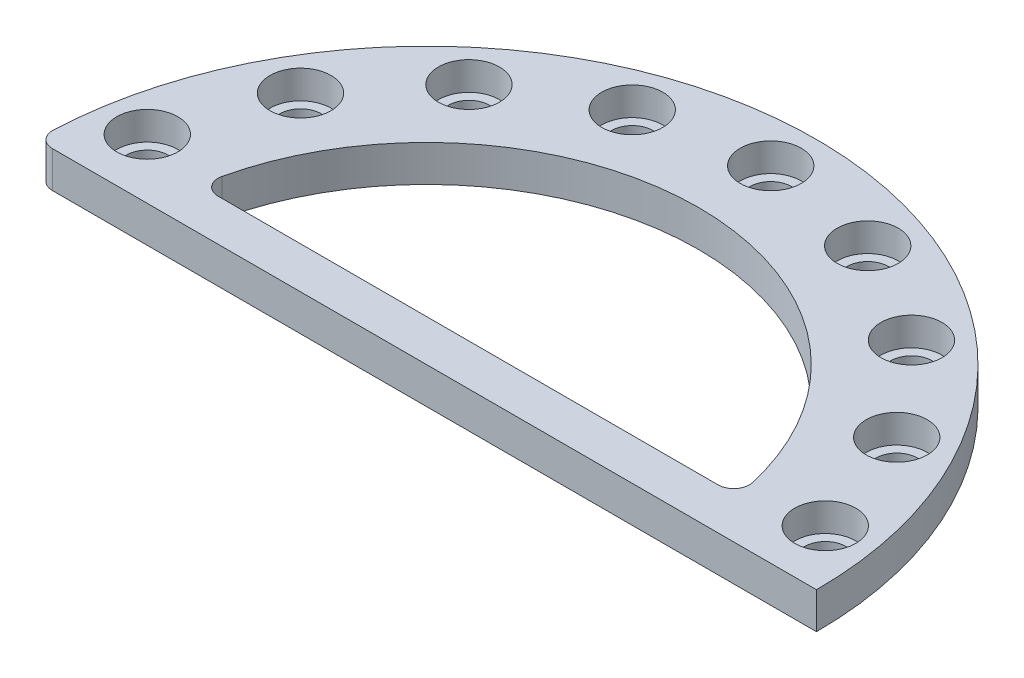
ISO-10303-21;
HEADER;
FILE_DESCRIPTION(('STEP AP214'),'2;1');
FILE_NAME('part.step','',(''),(''),'','','');
FILE_SCHEMA(('AUTOMOTIVE_DESIGN { 1 0 10303 214 1 1 1 1 }'));
ENDSEC;
DATA;
#1=APPLICATION_CONTEXT('core data for automotive mechanical design processes');
#2=APPLICATION_PROTOCOL_DEFINITION('international standard','automotive_design',2000,#1);
#3=PRODUCT_CONTEXT('',#1,'mechanical');
#4=PRODUCT('Part','Part','',(#3));
#5=PRODUCT_RELATED_PRODUCT_CATEGORY('part','',(#4));
#6=PRODUCT_DEFINITION_FORMATION('','',#4);
#7=PRODUCT_DEFINITION_CONTEXT('part definition',#1,'design');
#8=PRODUCT_DEFINITION('design','',#6,#7);
#9=PRODUCT_DEFINITION_SHAPE('','',#8);
#10=(LENGTH_UNIT() NAMED_UNIT(*) SI_UNIT(.MILLI.,.METRE.));
#11=(NAMED_UNIT(*) PLANE_ANGLE_UNIT() SI_UNIT($,.RADIAN.));
#12=(NAMED_UNIT(*) SI_UNIT($,.STERADIAN.) SOLID_ANGLE_UNIT());
#13=UNCERTAINTY_MEASURE_WITH_UNIT(LENGTH_MEASURE(1.E-05),#10,'distance_accuracy_value','');
#14=(GEOMETRIC_REPRESENTATION_CONTEXT(3) GLOBAL_UNCERTAINTY_ASSIGNED_CONTEXT((#13)) GLOBAL_UNIT_ASSIGNED_CONTEXT((#10,
#11,#12)) REPRESENTATION_CONTEXT('',''));
#15=CARTESIAN_POINT('',(0.,0.,0.));
#16=DIRECTION('',(0.,0.,1.));
#17=DIRECTION('',(1.,0.,0.));
#18=AXIS2_PLACEMENT_3D('',#15,#16,#17);
#19=CARTESIAN_POINT('',(0.,0.,0.));
#20=DIRECTION('',(0.,0.,1.));
#21=DIRECTION('',(1.,0.,0.));
#22=AXIS2_PLACEMENT_3D('',#19,#20,#21);
#23=PLANE('',#22);
#24=DIRECTION('',(1.,0.,0.));
#25=VECTOR('',#24,1.);
#26=CARTESIAN_POINT('',(0.,7.,0.));
#27=LINE('',#26,#25);
#28=CARTESIAN_POINT('',(-71.9374728496908,7.,0.));
#29=VERTEX_POINT('',#28);
#30=CARTESIAN_POINT('',(75.,7.,0.));
#31=VERTEX_POINT('',#30);
#32=EDGE_CURVE('E95',#29,#31,#27,.T.);
#33=ORIENTED_EDGE('',*,*,#32,.F.);
#34=DIRECTION('',(0.,1.,0.));
#35=VECTOR('',#34,1.);
#36=CARTESIAN_POINT('',(-71.9374728496908,0.,0.));
#37=LINE('',#36,#35);
#38=CARTESIAN_POINT('',(-71.9374728496908,0.,0.));
#39=VERTEX_POINT('',#38);
#40=EDGE_CURVE('E127',#29,#39,#37,.F.);
#41=ORIENTED_EDGE('',*,*,#40,.T.);
#42=DIRECTION('',(1.,0.,0.));
#43=VECTOR('',#42,1.);
#44=CARTESIAN_POINT('',(0.,0.,0.));
#45=LINE('',#44,#43);
#46=CARTESIAN_POINT('',(75.,0.,0.));
#47=VERTEX_POINT('',#46);
#48=EDGE_CURVE('E104',#39,#47,#45,.T.);
#49=ORIENTED_EDGE('',*,*,#48,.T.);
#50=DIRECTION('',(0.,-1.,0.));
#51=VECTOR('',#50,1.);
#52=CARTESIAN_POINT('',(75.,7.,0.));
#53=LINE('',#52,#51);
#54=EDGE_CURVE('E108',#47,#31,#53,.F.);
#55=ORIENTED_EDGE('',*,*,#54,.T.);
#56=EDGE_LOOP('',(#33,#41,#49,#55));
#57=FACE_BOUND('',#56,.T.);
#58=ADVANCED_FACE('F36',(#57),#23,.T.);
#59=CARTESIAN_POINT('',(0.,7.,0.));
#60=DIRECTION('',(0.,1.,0.));
#61=DIRECTION('',(0.,0.,1.));
#62=AXIS2_PLACEMENT_3D('',#59,#60,#61);
#63=PLANE('',#62);
#64=DIRECTION('',(1.,0.,0.));
#65=VECTOR('',#64,1.);
#66=CARTESIAN_POINT('',(-51.7098213591964,7.,-8.));
#67=LINE('',#66,#65);
#68=CARTESIAN_POINT('',(-48.0827996793032,7.,-8.));
#69=VERTEX_POINT('',#68);
#70=CARTESIAN_POINT('',(48.0827996793032,7.,-8.));
#71=VERTEX_POINT('',#70);
#72=EDGE_CURVE('E115',#69,#71,#67,.T.);
#73=ORIENTED_EDGE('',*,*,#72,.F.);
#74=CARTESIAN_POINT('',(-48.0827996793032,7.,-11.));
#75=DIRECTION('',(0.,1.,0.));
#76=DIRECTION('',(0.,0.,1.));
#77=AXIS2_PLACEMENT_3D('',#74,#75,#76);
#78=CIRCLE('',#77,3.);
#79=CARTESIAN_POINT('',(-51.0072477084549,7.,-11.6690319310694));
#80=VERTEX_POINT('',#79);
#81=EDGE_CURVE('E12',#69,#80,#78,.F.);
#82=ORIENTED_EDGE('',*,*,#81,.T.);
#83=CARTESIAN_POINT('',(0.,7.,0.));
#84=DIRECTION('',(0.,1.,0.));
#85=DIRECTION('',(0.,0.,1.));
#86=AXIS2_PLACEMENT_3D('',#83,#84,#85);
#87=CIRCLE('',#86,52.325);
#88=CARTESIAN_POINT('',(51.0072477084549,7.,-11.6690319310694));
#89=VERTEX_POINT('',#88);
#90=EDGE_CURVE('E152',#89,#80,#87,.T.);
#91=ORIENTED_EDGE('',*,*,#90,.F.);
#92=CARTESIAN_POINT('',(48.0827996793032,7.,-11.));
#93=DIRECTION('',(0.,1.,0.));
#94=DIRECTION('',(0.,0.,1.));
#95=AXIS2_PLACEMENT_3D('',#92,#93,#94);
#96=CIRCLE('',#95,3.);
#97=EDGE_CURVE('E134',#89,#71,#96,.F.);
#98=ORIENTED_EDGE('',*,*,#97,.T.);
#99=EDGE_LOOP('',(#73,#82,#91,#98));
#100=FACE_BOUND('',#99,.T.);
#101=CARTESIAN_POINT('',(0.,7.,-66.2));
#102=DIRECTION('',(0.,1.,0.));
#103=DIRECTION('',(0.,0.,1.));
#104=AXIS2_PLACEMENT_3D('',#101,#102,#103);
#105=CIRCLE('',#104,5.875);
#106=CARTESIAN_POINT('',(0.,7.,-60.325));
#107=VERTEX_POINT('',#106);
#108=EDGE_CURVE('E167',#107,#107,#105,.T.);
#109=ORIENTED_EDGE('',*,*,#108,.F.);
#110=EDGE_LOOP('',(#109));
#111=FACE_BOUND('',#110,.T.);
#112=CARTESIAN_POINT('',(22.6417334881593,7.,-62.2076514960271));
#113=DIRECTION('',(0.,1.,0.));
#114=DIRECTION('',(-0.342020143325669,0.,0.939692620785908));
#115=AXIS2_PLACEMENT_3D('',#112,#113,#114);
#116=CIRCLE('',#115,5.875);
#117=CARTESIAN_POINT('',(20.632365146121,7.,-56.6869573489099));
#118=VERTEX_POINT('',#117);
#119=EDGE_CURVE('E180',#118,#118,#116,.T.);
#120=ORIENTED_EDGE('',*,*,#119,.F.);
#121=EDGE_LOOP('',(#120));
#122=FACE_BOUND('',#121,.T.);
#123=CARTESIAN_POINT('',(42.552539761249,7.,-50.7121421344763));
#124=DIRECTION('',(0.,1.,0.));
#125=DIRECTION('',(-0.642787609686541,0.,0.766044443118977));
#126=AXIS2_PLACEMENT_3D('',#123,#124,#125);
#127=CIRCLE('',#126,5.875);
#128=CARTESIAN_POINT('',(38.7761625543406,7.,-46.2116310311523));
#129=VERTEX_POINT('',#128);
#130=EDGE_CURVE('E223',#129,#129,#127,.T.);
#131=ORIENTED_EDGE('',*,*,#130,.F.);
#132=EDGE_LOOP('',(#131));
#133=FACE_BOUND('',#132,.T.);
#134=CARTESIAN_POINT('',(57.3308817305299,7.,-33.0999999999999));
#135=DIRECTION('',(0.,1.,0.));
#136=DIRECTION('',(-0.86602540378444,0.,0.499999999999998));
#137=AXIS2_PLACEMENT_3D('',#134,#135,#136);
#138=CIRCLE('',#137,5.875);
#139=CARTESIAN_POINT('',(52.2429824832963,7.,-30.1624999999999));
#140=VERTEX_POINT('',#139);
#141=EDGE_CURVE('E217',#140,#140,#138,.T.);
#142=ORIENTED_EDGE('',*,*,#141,.F.);
#143=EDGE_LOOP('',(#142));
#144=FACE_BOUND('',#143,.T.);
#145=CARTESIAN_POINT('',(65.1942732494082,7.,-11.4955093615506));
#146=DIRECTION('',(0.,1.,0.));
#147=DIRECTION('',(-0.984807753012209,0.,0.173648177666927));
#148=AXIS2_PLACEMENT_3D('',#145,#146,#147);
#149=CIRCLE('',#148,5.875);
#150=CARTESIAN_POINT('',(59.4085277004615,7.,-10.4753263177574));
#151=VERTEX_POINT('',#150);
#152=EDGE_CURVE('E211',#151,#151,#149,.T.);
#153=ORIENTED_EDGE('',*,*,#152,.F.);
#154=EDGE_LOOP('',(#153));
#155=FACE_BOUND('',#154,.T.);
#156=CARTESIAN_POINT('',(-65.194273249408,7.,-11.4955093615515));
#157=DIRECTION('',(0.,1.,0.));
#158=DIRECTION('',(0.984807753012206,0.,0.17364817766694));
#159=AXIS2_PLACEMENT_3D('',#156,#157,#158);
#160=CIRCLE('',#159,5.875);
#161=CARTESIAN_POINT('',(-59.4085277004613,7.,-10.4753263177582));
#162=VERTEX_POINT('',#161);
#163=EDGE_CURVE('E205',#162,#162,#160,.T.);
#164=ORIENTED_EDGE('',*,*,#163,.F.);
#165=EDGE_LOOP('',(#164));
#166=FACE_BOUND('',#165,.T.);
#167=CARTESIAN_POINT('',(-57.3308817305294,7.,-33.1000000000007));
#168=DIRECTION('',(0.,1.,0.));
#169=DIRECTION('',(0.866025403784433,0.,0.50000000000001));
#170=AXIS2_PLACEMENT_3D('',#167,#168,#169);
#171=CIRCLE('',#170,5.875);
#172=CARTESIAN_POINT('',(-52.2429824832959,7.,-30.1625000000006));
#173=VERTEX_POINT('',#172);
#174=EDGE_CURVE('E199',#173,#173,#171,.T.);
#175=ORIENTED_EDGE('',*,*,#174,.F.);
#176=EDGE_LOOP('',(#175));
#177=FACE_BOUND('',#176,.T.);
#178=CARTESIAN_POINT('',(-42.5525397612483,7.,-50.7121421344769));
#179=DIRECTION('',(0.,1.,0.));
#180=DIRECTION('',(0.64278760968653,0.,0.766044443118986));
#181=AXIS2_PLACEMENT_3D('',#178,#179,#180);
#182=CIRCLE('',#181,5.875);
#183=CARTESIAN_POINT('',(-38.7761625543399,7.,-46.2116310311528));
#184=VERTEX_POINT('',#183);
#185=EDGE_CURVE('E193',#184,#184,#182,.T.);
#186=ORIENTED_EDGE('',*,*,#185,.F.);
#187=EDGE_LOOP('',(#186));
#188=FACE_BOUND('',#187,.T.);
#189=CARTESIAN_POINT('',(-22.6417334881585,7.,-62.2076514960274));
#190=DIRECTION('',(0.,1.,0.));
#191=DIRECTION('',(0.342020143325657,0.,0.939692620785913));
#192=AXIS2_PLACEMENT_3D('',#189,#190,#191);
#193=CIRCLE('',#192,5.875);
#194=CARTESIAN_POINT('',(-20.6323651461203,7.,-56.6869573489102));
#195=VERTEX_POINT('',#194);
#196=EDGE_CURVE('E186',#195,#195,#193,.T.);
#197=ORIENTED_EDGE('',*,*,#196,.F.);
#198=EDGE_LOOP('',(#197));
#199=FACE_BOUND('',#198,.T.);
#200=CARTESIAN_POINT('',(0.,7.,0.));
#201=DIRECTION('',(0.,1.,0.));
#202=DIRECTION('',(0.,0.,1.));
#203=AXIS2_PLACEMENT_3D('',#200,#201,#202);
#204=CIRCLE('',#203,75.);
#205=CARTESIAN_POINT('',(-74.9348675517612,7.,-3.125));
#206=VERTEX_POINT('',#205);
#207=EDGE_CURVE('E97',#31,#206,#204,.T.);
#208=ORIENTED_EDGE('',*,*,#207,.T.);
#209=CARTESIAN_POINT('',(-71.9374728496908,7.,-3.));
#210=DIRECTION('',(0.,1.,0.));
#211=DIRECTION('',(0.,0.,1.));
#212=AXIS2_PLACEMENT_3D('',#209,#210,#211);
#213=CIRCLE('',#212,3.);
#214=EDGE_CURVE('E99',#206,#29,#213,.T.);
#215=ORIENTED_EDGE('',*,*,#214,.T.);
#216=ORIENTED_EDGE('',*,*,#32,.T.);
#217=EDGE_LOOP('',(#208,#215,#216));
#218=FACE_BOUND('',#217,.T.);
#219=ADVANCED_FACE('F96',(#100,#111,#122,#133,#144,#155,#166,#177,#188,#199,#218),#63,.T.);
#220=CARTESIAN_POINT('',(0.,0.,0.));
#221=DIRECTION('',(0.,1.,0.));
#222=DIRECTION('',(0.,0.,1.));
#223=AXIS2_PLACEMENT_3D('',#220,#221,#222);
#224=PLANE('',#223);
#225=DIRECTION('',(1.,0.,0.));
#226=VECTOR('',#225,1.);
#227=CARTESIAN_POINT('',(-51.7098213591964,0.,-8.));
#228=LINE('',#227,#226);
#229=CARTESIAN_POINT('',(-48.0827996793032,0.,-8.));
#230=VERTEX_POINT('',#229);
#231=CARTESIAN_POINT('',(48.0827996793032,0.,-8.));
#232=VERTEX_POINT('',#231);
#233=EDGE_CURVE('E141',#230,#232,#228,.T.);
#234=ORIENTED_EDGE('',*,*,#233,.T.);
#235=CARTESIAN_POINT('',(48.0827996793032,0.,-11.));
#236=DIRECTION('',(0.,1.,0.));
#237=DIRECTION('',(0.,0.,1.));
#238=AXIS2_PLACEMENT_3D('',#235,#236,#237);
#239=CIRCLE('',#238,3.);
#240=CARTESIAN_POINT('',(51.0072477084549,0.,-11.6690319310694));
#241=VERTEX_POINT('',#240);
#242=EDGE_CURVE('E132',#232,#241,#239,.T.);
#243=ORIENTED_EDGE('',*,*,#242,.T.);
#244=CARTESIAN_POINT('',(0.,0.,0.));
#245=DIRECTION('',(0.,1.,0.));
#246=DIRECTION('',(0.,0.,1.));
#247=AXIS2_PLACEMENT_3D('',#244,#245,#246);
#248=CIRCLE('',#247,52.325);
#249=CARTESIAN_POINT('',(-51.0072477084549,0.,-11.6690319310694));
#250=VERTEX_POINT('',#249);
#251=EDGE_CURVE('E143',#241,#250,#248,.T.);
#252=ORIENTED_EDGE('',*,*,#251,.T.);
#253=CARTESIAN_POINT('',(-48.0827996793032,0.,-11.));
#254=DIRECTION('',(0.,1.,0.));
#255=DIRECTION('',(0.,0.,1.));
#256=AXIS2_PLACEMENT_3D('',#253,#254,#255);
#257=CIRCLE('',#256,3.);
#258=EDGE_CURVE('E44',#250,#230,#257,.T.);
#259=ORIENTED_EDGE('',*,*,#258,.T.);
#260=EDGE_LOOP('',(#234,#243,#252,#259));
#261=FACE_BOUND('',#260,.T.);
#262=CARTESIAN_POINT('',(0.,0.,-66.2));
#263=DIRECTION('',(0.,1.,0.));
#264=DIRECTION('',(0.,0.,1.));
#265=AXIS2_PLACEMENT_3D('',#262,#263,#264);
#266=CIRCLE('',#265,4.);
#267=CARTESIAN_POINT('',(0.,0.,-62.2));
#268=VERTEX_POINT('',#267);
#269=EDGE_CURVE('E170',#268,#268,#266,.T.);
#270=ORIENTED_EDGE('',*,*,#269,.T.);
#271=EDGE_LOOP('',(#270));
#272=FACE_BOUND('',#271,.T.);
#273=CARTESIAN_POINT('',(22.6417334881593,0.,-62.2076514960271));
#274=DIRECTION('',(0.,1.,0.));
#275=DIRECTION('',(-0.342020143325669,0.,0.939692620785908));
#276=AXIS2_PLACEMENT_3D('',#273,#274,#275);
#277=CIRCLE('',#276,4.);
#278=CARTESIAN_POINT('',(21.2736529148566,0.,-58.4488810128835));
#279=VERTEX_POINT('',#278);
#280=EDGE_CURVE('E189',#279,#279,#277,.T.);
#281=ORIENTED_EDGE('',*,*,#280,.T.);
#282=EDGE_LOOP('',(#281));
#283=FACE_BOUND('',#282,.T.);
#284=CARTESIAN_POINT('',(42.552539761249,0.,-50.7121421344763));
#285=DIRECTION('',(0.,1.,0.));
#286=DIRECTION('',(-0.642787609686541,0.,0.766044443118977));
#287=AXIS2_PLACEMENT_3D('',#284,#285,#286);
#288=CIRCLE('',#287,4.);
#289=CARTESIAN_POINT('',(39.9813893225028,0.,-47.6479643620004));
#290=VERTEX_POINT('',#289);
#291=EDGE_CURVE('E231',#290,#290,#288,.T.);
#292=ORIENTED_EDGE('',*,*,#291,.T.);
#293=EDGE_LOOP('',(#292));
#294=FACE_BOUND('',#293,.T.);
#295=CARTESIAN_POINT('',(57.3308817305299,0.,-33.0999999999999));
#296=DIRECTION('',(0.,1.,0.));
#297=DIRECTION('',(-0.86602540378444,0.,0.499999999999998));
#298=AXIS2_PLACEMENT_3D('',#295,#296,#297);
#299=CIRCLE('',#298,4.);
#300=CARTESIAN_POINT('',(53.8667801153922,0.,-31.0999999999999));
#301=VERTEX_POINT('',#300);
#302=EDGE_CURVE('E266',#301,#301,#299,.T.);
#303=ORIENTED_EDGE('',*,*,#302,.T.);
#304=EDGE_LOOP('',(#303));
#305=FACE_BOUND('',#304,.T.);
#306=CARTESIAN_POINT('',(65.1942732494082,0.,-11.4955093615506));
#307=DIRECTION('',(0.,1.,0.));
#308=DIRECTION('',(-0.984807753012209,0.,0.173648177666927));
#309=AXIS2_PLACEMENT_3D('',#306,#307,#308);
#310=CIRCLE('',#309,4.);
#311=CARTESIAN_POINT('',(61.2550422373594,0.,-10.8009166508829));
#312=VERTEX_POINT('',#311);
#313=EDGE_CURVE('E260',#312,#312,#310,.T.);
#314=ORIENTED_EDGE('',*,*,#313,.T.);
#315=EDGE_LOOP('',(#314));
#316=FACE_BOUND('',#315,.T.);
#317=CARTESIAN_POINT('',(-65.194273249408,0.,-11.4955093615515));
#318=DIRECTION('',(0.,1.,0.));
#319=DIRECTION('',(0.984807753012206,0.,0.17364817766694));
#320=AXIS2_PLACEMENT_3D('',#317,#318,#319);
#321=CIRCLE('',#320,4.);
#322=CARTESIAN_POINT('',(-61.2550422373592,0.,-10.8009166508837));
#323=VERTEX_POINT('',#322);
#324=EDGE_CURVE('E254',#323,#323,#321,.T.);
#325=ORIENTED_EDGE('',*,*,#324,.T.);
#326=EDGE_LOOP('',(#325));
#327=FACE_BOUND('',#326,.T.);
#328=CARTESIAN_POINT('',(-57.3308817305294,0.,-33.1000000000007));
#329=DIRECTION('',(0.,1.,0.));
#330=DIRECTION('',(0.866025403784433,0.,0.50000000000001));
#331=AXIS2_PLACEMENT_3D('',#328,#329,#330);
#332=CIRCLE('',#331,4.);
#333=CARTESIAN_POINT('',(-53.8667801153917,0.,-31.1000000000006));
#334=VERTEX_POINT('',#333);
#335=EDGE_CURVE('E248',#334,#334,#332,.T.);
#336=ORIENTED_EDGE('',*,*,#335,.T.);
#337=EDGE_LOOP('',(#336));
#338=FACE_BOUND('',#337,.T.);
#339=CARTESIAN_POINT('',(-42.5525397612483,0.,-50.7121421344769));
#340=DIRECTION('',(0.,1.,0.));
#341=DIRECTION('',(0.64278760968653,0.,0.766044443118986));
#342=AXIS2_PLACEMENT_3D('',#339,#340,#341);
#343=CIRCLE('',#342,4.);
#344=CARTESIAN_POINT('',(-39.9813893225022,0.,-47.6479643620009));
#345=VERTEX_POINT('',#344);
#346=EDGE_CURVE('E242',#345,#345,#343,.T.);
#347=ORIENTED_EDGE('',*,*,#346,.T.);
#348=EDGE_LOOP('',(#347));
#349=FACE_BOUND('',#348,.T.);
#350=CARTESIAN_POINT('',(-22.6417334881585,0.,-62.2076514960274));
#351=DIRECTION('',(0.,1.,0.));
#352=DIRECTION('',(0.342020143325657,0.,0.939692620785913));
#353=AXIS2_PLACEMENT_3D('',#350,#351,#352);
#354=CIRCLE('',#353,4.);
#355=CARTESIAN_POINT('',(-21.2736529148559,0.,-58.4488810128838));
#356=VERTEX_POINT('',#355);
#357=EDGE_CURVE('E236',#356,#356,#354,.T.);
#358=ORIENTED_EDGE('',*,*,#357,.T.);
#359=EDGE_LOOP('',(#358));
#360=FACE_BOUND('',#359,.T.);
#361=ORIENTED_EDGE('',*,*,#48,.F.);
#362=CARTESIAN_POINT('',(-71.9374728496908,0.,-3.));
#363=DIRECTION('',(0.,1.,0.));
#364=DIRECTION('',(0.,0.,1.));
#365=AXIS2_PLACEMENT_3D('',#362,#363,#364);
#366=CIRCLE('',#365,3.);
#367=CARTESIAN_POINT('',(-74.9348675517612,0.,-3.125));
#368=VERTEX_POINT('',#367);
#369=EDGE_CURVE('E59',#39,#368,#366,.F.);
#370=ORIENTED_EDGE('',*,*,#369,.T.);
#371=CARTESIAN_POINT('',(0.,0.,0.));
#372=DIRECTION('',(0.,1.,0.));
#373=DIRECTION('',(0.,0.,1.));
#374=AXIS2_PLACEMENT_3D('',#371,#372,#373);
#375=CIRCLE('',#374,75.);
#376=EDGE_CURVE('E109',#47,#368,#375,.T.);
#377=ORIENTED_EDGE('',*,*,#376,.F.);
#378=EDGE_LOOP('',(#361,#370,#377));
#379=FACE_BOUND('',#378,.T.);
#380=ADVANCED_FACE('F139',(#261,#272,#283,#294,#305,#316,#327,#338,#349,#360,#379),#224,.F.);
#381=CARTESIAN_POINT('',(0.,7.,0.));
#382=DIRECTION('',(0.,-1.,0.));
#383=DIRECTION('',(0.,0.,-1.));
#384=AXIS2_PLACEMENT_3D('',#381,#382,#383);
#385=CYLINDRICAL_SURFACE('',#384,75.);
#386=ORIENTED_EDGE('',*,*,#376,.T.);
#387=DIRECTION('',(0.,-1.,0.));
#388=VECTOR('',#387,1.);
#389=CARTESIAN_POINT('',(-74.9348675517613,7.,-3.125));
#390=LINE('',#389,#388);
#391=EDGE_CURVE('E51',#368,#206,#390,.F.);
#392=ORIENTED_EDGE('',*,*,#391,.T.);
#393=ORIENTED_EDGE('',*,*,#207,.F.);
#394=ORIENTED_EDGE('',*,*,#54,.F.);
#395=EDGE_LOOP('',(#386,#392,#393,#394));
#396=FACE_BOUND('',#395,.T.);
#397=ADVANCED_FACE('F107',(#396),#385,.T.);
#398=CARTESIAN_POINT('',(0.,7.,0.));
#399=DIRECTION('',(0.,-1.,0.));
#400=DIRECTION('',(0.,0.,-1.));
#401=AXIS2_PLACEMENT_3D('',#398,#399,#400);
#402=CYLINDRICAL_SURFACE('',#401,52.325);
#403=ORIENTED_EDGE('',*,*,#251,.F.);
#404=DIRECTION('',(0.,-1.,0.));
#405=VECTOR('',#404,1.);
#406=CARTESIAN_POINT('',(51.0072477084549,7.,-11.6690319310694));
#407=LINE('',#406,#405);
#408=EDGE_CURVE('E125',#241,#89,#407,.F.);
#409=ORIENTED_EDGE('',*,*,#408,.T.);
#410=ORIENTED_EDGE('',*,*,#90,.T.);
#411=DIRECTION('',(0.,-1.,0.));
#412=VECTOR('',#411,1.);
#413=CARTESIAN_POINT('',(-51.0072477084549,7.,-11.6690319310694));
#414=LINE('',#413,#412);
#415=EDGE_CURVE('E122',#80,#250,#414,.T.);
#416=ORIENTED_EDGE('',*,*,#415,.T.);
#417=EDGE_LOOP('',(#403,#409,#410,#416));
#418=FACE_BOUND('',#417,.T.);
#419=ADVANCED_FACE('F161',(#418),#402,.F.);
#420=CARTESIAN_POINT('',(-51.7098213591964,7.,-8.));
#421=DIRECTION('',(0.,0.,-1.));
#422=DIRECTION('',(-1.,0.,0.));
#423=AXIS2_PLACEMENT_3D('',#420,#421,#422);
#424=PLANE('',#423);
#425=ORIENTED_EDGE('',*,*,#72,.T.);
#426=DIRECTION('',(0.,1.,0.));
#427=VECTOR('',#426,1.);
#428=CARTESIAN_POINT('',(48.0827996793032,0.,-8.));
#429=LINE('',#428,#427);
#430=EDGE_CURVE('E118',#71,#232,#429,.F.);
#431=ORIENTED_EDGE('',*,*,#430,.T.);
#432=ORIENTED_EDGE('',*,*,#233,.F.);
#433=DIRECTION('',(0.,1.,0.));
#434=VECTOR('',#433,1.);
#435=CARTESIAN_POINT('',(-48.0827996793032,7.,-8.));
#436=LINE('',#435,#434);
#437=EDGE_CURVE('E116',#230,#69,#436,.T.);
#438=ORIENTED_EDGE('',*,*,#437,.T.);
#439=EDGE_LOOP('',(#425,#431,#432,#438));
#440=FACE_BOUND('',#439,.T.);
#441=ADVANCED_FACE('F149',(#440),#424,.T.);
#442=CARTESIAN_POINT('',(0.,1.55,-66.2));
#443=DIRECTION('',(0.,1.,0.));
#444=DIRECTION('',(0.,0.,1.));
#445=AXIS2_PLACEMENT_3D('',#442,#443,#444);
#446=CYLINDRICAL_SURFACE('',#445,5.875);
#447=CARTESIAN_POINT('',(0.,1.55,-66.2));
#448=DIRECTION('',(0.,1.,0.));
#449=DIRECTION('',(0.,0.,1.));
#450=AXIS2_PLACEMENT_3D('',#447,#448,#449);
#451=CIRCLE('',#450,5.875);
#452=CARTESIAN_POINT('',(0.,1.55,-60.325));
#453=VERTEX_POINT('',#452);
#454=EDGE_CURVE('E171',#453,#453,#451,.T.);
#455=ORIENTED_EDGE('',*,*,#454,.F.);
#456=EDGE_LOOP('',(#455));
#457=FACE_BOUND('',#456,.T.);
#458=ORIENTED_EDGE('',*,*,#108,.T.);
#459=EDGE_LOOP('',(#458));
#460=FACE_BOUND('',#459,.T.);
#461=ADVANCED_FACE('F430',(#457,#460),#446,.F.);
#462=CARTESIAN_POINT('',(0.,1.55,-66.2));
#463=DIRECTION('',(0.,1.,0.));
#464=DIRECTION('',(0.,0.,1.));
#465=AXIS2_PLACEMENT_3D('',#462,#463,#464);
#466=PLANE('',#465);
#467=CARTESIAN_POINT('',(0.,1.55,-66.2));
#468=DIRECTION('',(0.,1.,0.));
#469=DIRECTION('',(0.,0.,1.));
#470=AXIS2_PLACEMENT_3D('',#467,#468,#469);
#471=CIRCLE('',#470,4.);
#472=CARTESIAN_POINT('',(0.,1.55,-62.2));
#473=VERTEX_POINT('',#472);
#474=EDGE_CURVE('E174',#473,#473,#471,.T.);
#475=ORIENTED_EDGE('',*,*,#474,.F.);
#476=EDGE_LOOP('',(#475));
#477=FACE_BOUND('',#476,.T.);
#478=ORIENTED_EDGE('',*,*,#454,.T.);
#479=EDGE_LOOP('',(#478));
#480=FACE_BOUND('',#479,.T.);
#481=ADVANCED_FACE('F620',(#477,#480),#466,.T.);
#482=CARTESIAN_POINT('',(0.,0.,-66.2));
#483=DIRECTION('',(0.,1.,0.));
#484=DIRECTION('',(0.,0.,1.));
#485=AXIS2_PLACEMENT_3D('',#482,#483,#484);
#486=CYLINDRICAL_SURFACE('',#485,4.);
#487=ORIENTED_EDGE('',*,*,#269,.F.);
#488=EDGE_LOOP('',(#487));
#489=FACE_BOUND('',#488,.T.);
#490=ORIENTED_EDGE('',*,*,#474,.T.);
#491=EDGE_LOOP('',(#490));
#492=FACE_BOUND('',#491,.T.);
#493=ADVANCED_FACE('F611',(#489,#492),#486,.F.);
#494=CARTESIAN_POINT('',(22.6417334881593,1.55,-62.2076514960271));
#495=DIRECTION('',(0.,1.,0.));
#496=DIRECTION('',(0.,0.,1.));
#497=AXIS2_PLACEMENT_3D('',#494,#495,#496);
#498=CYLINDRICAL_SURFACE('',#497,5.875);
#499=CARTESIAN_POINT('',(22.6417334881593,1.55,-62.2076514960271));
#500=DIRECTION('',(0.,1.,0.));
#501=DIRECTION('',(-0.342020143325669,0.,0.939692620785908));
#502=AXIS2_PLACEMENT_3D('',#499,#500,#501);
#503=CIRCLE('',#502,5.875);
#504=CARTESIAN_POINT('',(20.632365146121,1.55,-56.6869573489099));
#505=VERTEX_POINT('',#504);
#506=EDGE_CURVE('E177',#505,#505,#503,.T.);
#507=ORIENTED_EDGE('',*,*,#506,.F.);
#508=EDGE_LOOP('',(#507));
#509=FACE_BOUND('',#508,.T.);
#510=ORIENTED_EDGE('',*,*,#119,.T.);
#511=EDGE_LOOP('',(#510));
#512=FACE_BOUND('',#511,.T.);
#513=ADVANCED_FACE('F602',(#509,#512),#498,.F.);
#514=CARTESIAN_POINT('',(22.6417334881593,1.55,-62.2076514960271));
#515=DIRECTION('',(0.,1.,0.));
#516=DIRECTION('',(-0.342020143325669,0.,0.939692620785908));
#517=AXIS2_PLACEMENT_3D('',#514,#515,#516);
#518=PLANE('',#517);
#519=CARTESIAN_POINT('',(22.6417334881593,1.55,-62.2076514960271));
#520=DIRECTION('',(0.,1.,0.));
#521=DIRECTION('',(-0.342020143325669,0.,0.939692620785908));
#522=AXIS2_PLACEMENT_3D('',#519,#520,#521);
#523=CIRCLE('',#522,4.);
#524=CARTESIAN_POINT('',(21.2736529148566,1.55,-58.4488810128835));
#525=VERTEX_POINT('',#524);
#526=EDGE_CURVE('E228',#525,#525,#523,.T.);
#527=ORIENTED_EDGE('',*,*,#526,.F.);
#528=EDGE_LOOP('',(#527));
#529=FACE_BOUND('',#528,.T.);
#530=ORIENTED_EDGE('',*,*,#506,.T.);
#531=EDGE_LOOP('',(#530));
#532=FACE_BOUND('',#531,.T.);
#533=ADVANCED_FACE('F295',(#529,#532),#518,.T.);
#534=CARTESIAN_POINT('',(42.552539761249,1.55,-50.7121421344763));
#535=DIRECTION('',(0.,1.,0.));
#536=DIRECTION('',(0.,0.,1.));
#537=AXIS2_PLACEMENT_3D('',#534,#535,#536);
#538=CYLINDRICAL_SURFACE('',#537,5.875);
#539=CARTESIAN_POINT('',(42.552539761249,1.55,-50.7121421344763));
#540=DIRECTION('',(0.,1.,0.));
#541=DIRECTION('',(-0.642787609686541,0.,0.766044443118977));
#542=AXIS2_PLACEMENT_3D('',#539,#540,#541);
#543=CIRCLE('',#542,5.875);
#544=CARTESIAN_POINT('',(38.7761625543406,1.55,-46.2116310311523));
#545=VERTEX_POINT('',#544);
#546=EDGE_CURVE('E183',#545,#545,#543,.T.);
#547=ORIENTED_EDGE('',*,*,#546,.F.);
#548=EDGE_LOOP('',(#547));
#549=FACE_BOUND('',#548,.T.);
#550=ORIENTED_EDGE('',*,*,#130,.T.);
#551=EDGE_LOOP('',(#550));
#552=FACE_BOUND('',#551,.T.);
#553=ADVANCED_FACE('F289',(#549,#552),#538,.F.);
#554=CARTESIAN_POINT('',(42.552539761249,1.55,-50.7121421344763));
#555=DIRECTION('',(0.,1.,0.));
#556=DIRECTION('',(-0.642787609686541,0.,0.766044443118977));
#557=AXIS2_PLACEMENT_3D('',#554,#555,#556);
#558=PLANE('',#557);
#559=CARTESIAN_POINT('',(42.552539761249,1.55,-50.7121421344763));
#560=DIRECTION('',(0.,1.,0.));
#561=DIRECTION('',(-0.642787609686541,0.,0.766044443118977));
#562=AXIS2_PLACEMENT_3D('',#559,#560,#561);
#563=CIRCLE('',#562,4.);
#564=CARTESIAN_POINT('',(39.9813893225028,1.55,-47.6479643620004));
#565=VERTEX_POINT('',#564);
#566=EDGE_CURVE('E269',#565,#565,#563,.T.);
#567=ORIENTED_EDGE('',*,*,#566,.F.);
#568=EDGE_LOOP('',(#567));
#569=FACE_BOUND('',#568,.T.);
#570=ORIENTED_EDGE('',*,*,#546,.T.);
#571=EDGE_LOOP('',(#570));
#572=FACE_BOUND('',#571,.T.);
#573=ADVANCED_FACE('F285',(#569,#572),#558,.T.);
#574=CARTESIAN_POINT('',(57.3308817305299,1.55,-33.0999999999999));
#575=DIRECTION('',(0.,1.,0.));
#576=DIRECTION('',(0.,0.,1.));
#577=AXIS2_PLACEMENT_3D('',#574,#575,#576);
#578=CYLINDRICAL_SURFACE('',#577,5.875);
#579=CARTESIAN_POINT('',(57.3308817305299,1.55,-33.0999999999999));
#580=DIRECTION('',(0.,1.,0.));
#581=DIRECTION('',(-0.86602540378444,0.,0.499999999999998));
#582=AXIS2_PLACEMENT_3D('',#579,#580,#581);
#583=CIRCLE('',#582,5.875);
#584=CARTESIAN_POINT('',(52.2429824832963,1.55,-30.1624999999999));
#585=VERTEX_POINT('',#584);
#586=EDGE_CURVE('E220',#585,#585,#583,.T.);
#587=ORIENTED_EDGE('',*,*,#586,.F.);
#588=EDGE_LOOP('',(#587));
#589=FACE_BOUND('',#588,.T.);
#590=ORIENTED_EDGE('',*,*,#141,.T.);
#591=EDGE_LOOP('',(#590));
#592=FACE_BOUND('',#591,.T.);
#593=ADVANCED_FACE('F288',(#589,#592),#578,.F.);
#594=CARTESIAN_POINT('',(57.3308817305299,1.55,-33.0999999999999));
#595=DIRECTION('',(0.,1.,0.));
#596=DIRECTION('',(-0.86602540378444,0.,0.499999999999998));
#597=AXIS2_PLACEMENT_3D('',#594,#595,#596);
#598=PLANE('',#597);
#599=CARTESIAN_POINT('',(57.3308817305299,1.55,-33.0999999999999));
#600=DIRECTION('',(0.,1.,0.));
#601=DIRECTION('',(-0.86602540378444,0.,0.499999999999998));
#602=AXIS2_PLACEMENT_3D('',#599,#600,#601);
#603=CIRCLE('',#602,4.);
#604=CARTESIAN_POINT('',(53.8667801153922,1.55,-31.0999999999999));
#605=VERTEX_POINT('',#604);
#606=EDGE_CURVE('E263',#605,#605,#603,.T.);
#607=ORIENTED_EDGE('',*,*,#606,.F.);
#608=EDGE_LOOP('',(#607));
#609=FACE_BOUND('',#608,.T.);
#610=ORIENTED_EDGE('',*,*,#586,.T.);
#611=EDGE_LOOP('',(#610));
#612=FACE_BOUND('',#611,.T.);
#613=ADVANCED_FACE('F356',(#609,#612),#598,.T.);
#614=CARTESIAN_POINT('',(65.1942732494082,1.55,-11.4955093615506));
#615=DIRECTION('',(0.,1.,0.));
#616=DIRECTION('',(0.,0.,1.));
#617=AXIS2_PLACEMENT_3D('',#614,#615,#616);
#618=CYLINDRICAL_SURFACE('',#617,5.875);
#619=CARTESIAN_POINT('',(65.1942732494082,1.55,-11.4955093615506));
#620=DIRECTION('',(0.,1.,0.));
#621=DIRECTION('',(-0.984807753012209,0.,0.173648177666927));
#622=AXIS2_PLACEMENT_3D('',#619,#620,#621);
#623=CIRCLE('',#622,5.875);
#624=CARTESIAN_POINT('',(59.4085277004615,1.55,-10.4753263177574));
#625=VERTEX_POINT('',#624);
#626=EDGE_CURVE('E214',#625,#625,#623,.T.);
#627=ORIENTED_EDGE('',*,*,#626,.F.);
#628=EDGE_LOOP('',(#627));
#629=FACE_BOUND('',#628,.T.);
#630=ORIENTED_EDGE('',*,*,#152,.T.);
#631=EDGE_LOOP('',(#630));
#632=FACE_BOUND('',#631,.T.);
#633=ADVANCED_FACE('F353',(#629,#632),#618,.F.);
#634=CARTESIAN_POINT('',(65.1942732494082,1.55,-11.4955093615506));
#635=DIRECTION('',(0.,1.,0.));
#636=DIRECTION('',(-0.984807753012209,0.,0.173648177666927));
#637=AXIS2_PLACEMENT_3D('',#634,#635,#636);
#638=PLANE('',#637);
#639=CARTESIAN_POINT('',(65.1942732494082,1.55,-11.4955093615506));
#640=DIRECTION('',(0.,1.,0.));
#641=DIRECTION('',(-0.984807753012209,0.,0.173648177666927));
#642=AXIS2_PLACEMENT_3D('',#639,#640,#641);
#643=CIRCLE('',#642,4.);
#644=CARTESIAN_POINT('',(61.2550422373594,1.55,-10.8009166508829));
#645=VERTEX_POINT('',#644);
#646=EDGE_CURVE('E257',#645,#645,#643,.T.);
#647=ORIENTED_EDGE('',*,*,#646,.F.);
#648=EDGE_LOOP('',(#647));
#649=FACE_BOUND('',#648,.T.);
#650=ORIENTED_EDGE('',*,*,#626,.T.);
#651=EDGE_LOOP('',(#650));
#652=FACE_BOUND('',#651,.T.);
#653=ADVANCED_FACE('F348',(#649,#652),#638,.T.);
#654=CARTESIAN_POINT('',(-65.194273249408,1.55,-11.4955093615515));
#655=DIRECTION('',(0.,1.,0.));
#656=DIRECTION('',(0.,0.,1.));
#657=AXIS2_PLACEMENT_3D('',#654,#655,#656);
#658=CYLINDRICAL_SURFACE('',#657,5.875);
#659=CARTESIAN_POINT('',(-65.194273249408,1.55,-11.4955093615515));
#660=DIRECTION('',(0.,1.,0.));
#661=DIRECTION('',(0.984807753012206,0.,0.17364817766694));
#662=AXIS2_PLACEMENT_3D('',#659,#660,#661);
#663=CIRCLE('',#662,5.875);
#664=CARTESIAN_POINT('',(-59.4085277004613,1.55,-10.4753263177582));
#665=VERTEX_POINT('',#664);
#666=EDGE_CURVE('E208',#665,#665,#663,.T.);
#667=ORIENTED_EDGE('',*,*,#666,.F.);
#668=EDGE_LOOP('',(#667));
#669=FACE_BOUND('',#668,.T.);
#670=ORIENTED_EDGE('',*,*,#163,.T.);
#671=EDGE_LOOP('',(#670));
#672=FACE_BOUND('',#671,.T.);
#673=ADVANCED_FACE('F345',(#669,#672),#658,.F.);
#674=CARTESIAN_POINT('',(-65.194273249408,1.55,-11.4955093615515));
#675=DIRECTION('',(0.,1.,0.));
#676=DIRECTION('',(0.984807753012206,0.,0.17364817766694));
#677=AXIS2_PLACEMENT_3D('',#674,#675,#676);
#678=PLANE('',#677);
#679=CARTESIAN_POINT('',(-65.194273249408,1.55,-11.4955093615515));
#680=DIRECTION('',(0.,1.,0.));
#681=DIRECTION('',(0.984807753012206,0.,0.17364817766694));
#682=AXIS2_PLACEMENT_3D('',#679,#680,#681);
#683=CIRCLE('',#682,4.);
#684=CARTESIAN_POINT('',(-61.2550422373592,1.55,-10.8009166508837));
#685=VERTEX_POINT('',#684);
#686=EDGE_CURVE('E251',#685,#685,#683,.T.);
#687=ORIENTED_EDGE('',*,*,#686,.F.);
#688=EDGE_LOOP('',(#687));
#689=FACE_BOUND('',#688,.T.);
#690=ORIENTED_EDGE('',*,*,#666,.T.);
#691=EDGE_LOOP('',(#690));
#692=FACE_BOUND('',#691,.T.);
#693=ADVANCED_FACE('F340',(#689,#692),#678,.T.);
#694=CARTESIAN_POINT('',(-57.3308817305294,1.55,-33.1000000000007));
#695=DIRECTION('',(0.,1.,0.));
#696=DIRECTION('',(0.,0.,1.));
#697=AXIS2_PLACEMENT_3D('',#694,#695,#696);
#698=CYLINDRICAL_SURFACE('',#697,5.875);
#699=CARTESIAN_POINT('',(-57.3308817305294,1.55,-33.1000000000007));
#700=DIRECTION('',(0.,1.,0.));
#701=DIRECTION('',(0.866025403784433,0.,0.50000000000001));
#702=AXIS2_PLACEMENT_3D('',#699,#700,#701);
#703=CIRCLE('',#702,5.875);
#704=CARTESIAN_POINT('',(-52.2429824832959,1.55,-30.1625000000006));
#705=VERTEX_POINT('',#704);
#706=EDGE_CURVE('E202',#705,#705,#703,.T.);
#707=ORIENTED_EDGE('',*,*,#706,.F.);
#708=EDGE_LOOP('',(#707));
#709=FACE_BOUND('',#708,.T.);
#710=ORIENTED_EDGE('',*,*,#174,.T.);
#711=EDGE_LOOP('',(#710));
#712=FACE_BOUND('',#711,.T.);
#713=ADVANCED_FACE('F337',(#709,#712),#698,.F.);
#714=CARTESIAN_POINT('',(-57.3308817305294,1.55,-33.1000000000007));
#715=DIRECTION('',(0.,1.,0.));
#716=DIRECTION('',(0.866025403784433,0.,0.50000000000001));
#717=AXIS2_PLACEMENT_3D('',#714,#715,#716);
#718=PLANE('',#717);
#719=CARTESIAN_POINT('',(-57.3308817305294,1.55,-33.1000000000007));
#720=DIRECTION('',(0.,1.,0.));
#721=DIRECTION('',(0.866025403784433,0.,0.50000000000001));
#722=AXIS2_PLACEMENT_3D('',#719,#720,#721);
#723=CIRCLE('',#722,4.);
#724=CARTESIAN_POINT('',(-53.8667801153917,1.55,-31.1000000000006));
#725=VERTEX_POINT('',#724);
#726=EDGE_CURVE('E245',#725,#725,#723,.T.);
#727=ORIENTED_EDGE('',*,*,#726,.F.);
#728=EDGE_LOOP('',(#727));
#729=FACE_BOUND('',#728,.T.);
#730=ORIENTED_EDGE('',*,*,#706,.T.);
#731=EDGE_LOOP('',(#730));
#732=FACE_BOUND('',#731,.T.);
#733=ADVANCED_FACE('F334',(#729,#732),#718,.T.);
#734=CARTESIAN_POINT('',(-42.5525397612483,1.55,-50.7121421344769));
#735=DIRECTION('',(0.,1.,0.));
#736=DIRECTION('',(0.,0.,1.));
#737=AXIS2_PLACEMENT_3D('',#734,#735,#736);
#738=CYLINDRICAL_SURFACE('',#737,5.875);
#739=CARTESIAN_POINT('',(-42.5525397612483,1.55,-50.7121421344769));
#740=DIRECTION('',(0.,1.,0.));
#741=DIRECTION('',(0.64278760968653,0.,0.766044443118986));
#742=AXIS2_PLACEMENT_3D('',#739,#740,#741);
#743=CIRCLE('',#742,5.875);
#744=CARTESIAN_POINT('',(-38.7761625543399,1.55,-46.2116310311528));
#745=VERTEX_POINT('',#744);
#746=EDGE_CURVE('E196',#745,#745,#743,.T.);
#747=ORIENTED_EDGE('',*,*,#746,.F.);
#748=EDGE_LOOP('',(#747));
#749=FACE_BOUND('',#748,.T.);
#750=ORIENTED_EDGE('',*,*,#185,.T.);
#751=EDGE_LOOP('',(#750));
#752=FACE_BOUND('',#751,.T.);
#753=ADVANCED_FACE('F326',(#749,#752),#738,.F.);
#754=CARTESIAN_POINT('',(-42.5525397612483,1.55,-50.7121421344769));
#755=DIRECTION('',(0.,1.,0.));
#756=DIRECTION('',(0.64278760968653,0.,0.766044443118986));
#757=AXIS2_PLACEMENT_3D('',#754,#755,#756);
#758=PLANE('',#757);
#759=CARTESIAN_POINT('',(-42.5525397612483,1.55,-50.7121421344769));
#760=DIRECTION('',(0.,1.,0.));
#761=DIRECTION('',(0.64278760968653,0.,0.766044443118986));
#762=AXIS2_PLACEMENT_3D('',#759,#760,#761);
#763=CIRCLE('',#762,4.);
#764=CARTESIAN_POINT('',(-39.9813893225022,1.55,-47.6479643620009));
#765=VERTEX_POINT('',#764);
#766=EDGE_CURVE('E239',#765,#765,#763,.T.);
#767=ORIENTED_EDGE('',*,*,#766,.F.);
#768=EDGE_LOOP('',(#767));
#769=FACE_BOUND('',#768,.T.);
#770=ORIENTED_EDGE('',*,*,#746,.T.);
#771=EDGE_LOOP('',(#770));
#772=FACE_BOUND('',#771,.T.);
#773=ADVANCED_FACE('F317',(#769,#772),#758,.T.);
#774=CARTESIAN_POINT('',(-22.6417334881585,1.55,-62.2076514960274));
#775=DIRECTION('',(0.,1.,0.));
#776=DIRECTION('',(0.,0.,1.));
#777=AXIS2_PLACEMENT_3D('',#774,#775,#776);
#778=CYLINDRICAL_SURFACE('',#777,5.875);
#779=CARTESIAN_POINT('',(-22.6417334881585,1.55,-62.2076514960274));
#780=DIRECTION('',(0.,1.,0.));
#781=DIRECTION('',(0.342020143325657,0.,0.939692620785913));
#782=AXIS2_PLACEMENT_3D('',#779,#780,#781);
#783=CIRCLE('',#782,5.875);
#784=CARTESIAN_POINT('',(-20.6323651461203,1.55,-56.6869573489102));
#785=VERTEX_POINT('',#784);
#786=EDGE_CURVE('E190',#785,#785,#783,.T.);
#787=ORIENTED_EDGE('',*,*,#786,.F.);
#788=EDGE_LOOP('',(#787));
#789=FACE_BOUND('',#788,.T.);
#790=ORIENTED_EDGE('',*,*,#196,.T.);
#791=EDGE_LOOP('',(#790));
#792=FACE_BOUND('',#791,.T.);
#793=ADVANCED_FACE('F314',(#789,#792),#778,.F.);
#794=CARTESIAN_POINT('',(-22.6417334881585,1.55,-62.2076514960274));
#795=DIRECTION('',(0.,1.,0.));
#796=DIRECTION('',(0.342020143325657,0.,0.939692620785913));
#797=AXIS2_PLACEMENT_3D('',#794,#795,#796);
#798=PLANE('',#797);
#799=CARTESIAN_POINT('',(-22.6417334881585,1.55,-62.2076514960274));
#800=DIRECTION('',(0.,1.,0.));
#801=DIRECTION('',(0.342020143325657,0.,0.939692620785913));
#802=AXIS2_PLACEMENT_3D('',#799,#800,#801);
#803=CIRCLE('',#802,4.);
#804=CARTESIAN_POINT('',(-21.2736529148559,1.55,-58.4488810128838));
#805=VERTEX_POINT('',#804);
#806=EDGE_CURVE('E119',#805,#805,#803,.T.);
#807=ORIENTED_EDGE('',*,*,#806,.F.);
#808=EDGE_LOOP('',(#807));
#809=FACE_BOUND('',#808,.T.);
#810=ORIENTED_EDGE('',*,*,#786,.T.);
#811=EDGE_LOOP('',(#810));
#812=FACE_BOUND('',#811,.T.);
#813=ADVANCED_FACE('F316',(#809,#812),#798,.T.);
#814=CARTESIAN_POINT('',(22.6417334881593,0.,-62.2076514960271));
#815=DIRECTION('',(0.,1.,0.));
#816=DIRECTION('',(0.,0.,1.));
#817=AXIS2_PLACEMENT_3D('',#814,#815,#816);
#818=CYLINDRICAL_SURFACE('',#817,4.);
#819=ORIENTED_EDGE('',*,*,#280,.F.);
#820=EDGE_LOOP('',(#819));
#821=FACE_BOUND('',#820,.T.);
#822=ORIENTED_EDGE('',*,*,#526,.T.);
#823=EDGE_LOOP('',(#822));
#824=FACE_BOUND('',#823,.T.);
#825=ADVANCED_FACE('F281',(#821,#824),#818,.F.);
#826=CARTESIAN_POINT('',(42.552539761249,0.,-50.7121421344763));
#827=DIRECTION('',(0.,1.,0.));
#828=DIRECTION('',(0.,0.,1.));
#829=AXIS2_PLACEMENT_3D('',#826,#827,#828);
#830=CYLINDRICAL_SURFACE('',#829,4.);
#831=ORIENTED_EDGE('',*,*,#291,.F.);
#832=EDGE_LOOP('',(#831));
#833=FACE_BOUND('',#832,.T.);
#834=ORIENTED_EDGE('',*,*,#566,.T.);
#835=EDGE_LOOP('',(#834));
#836=FACE_BOUND('',#835,.T.);
#837=ADVANCED_FACE('F277',(#833,#836),#830,.F.);
#838=CARTESIAN_POINT('',(57.3308817305299,0.,-33.0999999999999));
#839=DIRECTION('',(0.,1.,0.));
#840=DIRECTION('',(0.,0.,1.));
#841=AXIS2_PLACEMENT_3D('',#838,#839,#840);
#842=CYLINDRICAL_SURFACE('',#841,4.);
#843=ORIENTED_EDGE('',*,*,#302,.F.);
#844=EDGE_LOOP('',(#843));
#845=FACE_BOUND('',#844,.T.);
#846=ORIENTED_EDGE('',*,*,#606,.T.);
#847=EDGE_LOOP('',(#846));
#848=FACE_BOUND('',#847,.T.);
#849=ADVANCED_FACE('F280',(#845,#848),#842,.F.);
#850=CARTESIAN_POINT('',(65.1942732494082,0.,-11.4955093615506));
#851=DIRECTION('',(0.,1.,0.));
#852=DIRECTION('',(0.,0.,1.));
#853=AXIS2_PLACEMENT_3D('',#850,#851,#852);
#854=CYLINDRICAL_SURFACE('',#853,4.);
#855=ORIENTED_EDGE('',*,*,#313,.F.);
#856=EDGE_LOOP('',(#855));
#857=FACE_BOUND('',#856,.T.);
#858=ORIENTED_EDGE('',*,*,#646,.T.);
#859=EDGE_LOOP('',(#858));
#860=FACE_BOUND('',#859,.T.);
#861=ADVANCED_FACE('F386',(#857,#860),#854,.F.);
#862=CARTESIAN_POINT('',(-65.194273249408,0.,-11.4955093615515));
#863=DIRECTION('',(0.,1.,0.));
#864=DIRECTION('',(0.,0.,1.));
#865=AXIS2_PLACEMENT_3D('',#862,#863,#864);
#866=CYLINDRICAL_SURFACE('',#865,4.);
#867=ORIENTED_EDGE('',*,*,#324,.F.);
#868=EDGE_LOOP('',(#867));
#869=FACE_BOUND('',#868,.T.);
#870=ORIENTED_EDGE('',*,*,#686,.T.);
#871=EDGE_LOOP('',(#870));
#872=FACE_BOUND('',#871,.T.);
#873=ADVANCED_FACE('F382',(#869,#872),#866,.F.);
#874=CARTESIAN_POINT('',(-57.3308817305294,0.,-33.1000000000007));
#875=DIRECTION('',(0.,1.,0.));
#876=DIRECTION('',(0.,0.,1.));
#877=AXIS2_PLACEMENT_3D('',#874,#875,#876);
#878=CYLINDRICAL_SURFACE('',#877,4.);
#879=ORIENTED_EDGE('',*,*,#335,.F.);
#880=EDGE_LOOP('',(#879));
#881=FACE_BOUND('',#880,.T.);
#882=ORIENTED_EDGE('',*,*,#726,.T.);
#883=EDGE_LOOP('',(#882));
#884=FACE_BOUND('',#883,.T.);
#885=ADVANCED_FACE('F378',(#881,#884),#878,.F.);
#886=CARTESIAN_POINT('',(-42.5525397612483,0.,-50.7121421344769));
#887=DIRECTION('',(0.,1.,0.));
#888=DIRECTION('',(0.,0.,1.));
#889=AXIS2_PLACEMENT_3D('',#886,#887,#888);
#890=CYLINDRICAL_SURFACE('',#889,4.);
#891=ORIENTED_EDGE('',*,*,#346,.F.);
#892=EDGE_LOOP('',(#891));
#893=FACE_BOUND('',#892,.T.);
#894=ORIENTED_EDGE('',*,*,#766,.T.);
#895=EDGE_LOOP('',(#894));
#896=FACE_BOUND('',#895,.T.);
#897=ADVANCED_FACE('F374',(#893,#896),#890,.F.);
#898=CARTESIAN_POINT('',(-22.6417334881585,0.,-62.2076514960274));
#899=DIRECTION('',(0.,1.,0.));
#900=DIRECTION('',(0.,0.,1.));
#901=AXIS2_PLACEMENT_3D('',#898,#899,#900);
#902=CYLINDRICAL_SURFACE('',#901,4.);
#903=ORIENTED_EDGE('',*,*,#357,.F.);
#904=EDGE_LOOP('',(#903));
#905=FACE_BOUND('',#904,.T.);
#906=ORIENTED_EDGE('',*,*,#806,.T.);
#907=EDGE_LOOP('',(#906));
#908=FACE_BOUND('',#907,.T.);
#909=ADVANCED_FACE('F370',(#905,#908),#902,.F.);
#910=CARTESIAN_POINT('',(48.0827996793032,7.,-11.));
#911=DIRECTION('',(0.,-1.,0.));
#912=DIRECTION('',(0.,0.,-1.));
#913=AXIS2_PLACEMENT_3D('',#910,#911,#912);
#914=CYLINDRICAL_SURFACE('',#913,3.);
#915=ORIENTED_EDGE('',*,*,#97,.F.);
#916=ORIENTED_EDGE('',*,*,#408,.F.);
#917=ORIENTED_EDGE('',*,*,#242,.F.);
#918=ORIENTED_EDGE('',*,*,#430,.F.);
#919=EDGE_LOOP('',(#915,#916,#917,#918));
#920=FACE_BOUND('',#919,.T.);
#921=ADVANCED_FACE('F373',(#920),#914,.F.);
#922=CARTESIAN_POINT('',(-71.9374728496908,7.,-3.));
#923=DIRECTION('',(0.,-1.,0.));
#924=DIRECTION('',(0.,0.,-1.));
#925=AXIS2_PLACEMENT_3D('',#922,#923,#924);
#926=CYLINDRICAL_SURFACE('',#925,3.);
#927=ORIENTED_EDGE('',*,*,#214,.F.);
#928=ORIENTED_EDGE('',*,*,#391,.F.);
#929=ORIENTED_EDGE('',*,*,#369,.F.);
#930=ORIENTED_EDGE('',*,*,#40,.F.);
#931=EDGE_LOOP('',(#927,#928,#929,#930));
#932=FACE_BOUND('',#931,.T.);
#933=ADVANCED_FACE('F401',(#932),#926,.T.);
#934=CARTESIAN_POINT('',(-48.0827996793032,7.,-11.));
#935=DIRECTION('',(0.,-1.,0.));
#936=DIRECTION('',(0.,0.,-1.));
#937=AXIS2_PLACEMENT_3D('',#934,#935,#936);
#938=CYLINDRICAL_SURFACE('',#937,3.);
#939=ORIENTED_EDGE('',*,*,#81,.F.);
#940=ORIENTED_EDGE('',*,*,#437,.F.);
#941=ORIENTED_EDGE('',*,*,#258,.F.);
#942=ORIENTED_EDGE('',*,*,#415,.F.);
#943=EDGE_LOOP('',(#939,#940,#941,#942));
#944=FACE_BOUND('',#943,.T.);
#945=ADVANCED_FACE('F38',(#944),#938,.F.);
#946=CLOSED_SHELL('',(#58,#219,#380,#397,#419,#441,#461,#481,#493,#513,#533,#553,#573,#593,#613,
#633,#653,#673,#693,#713,#733,#753,#773,#793,#813,#825,#837,#849,#861,#873,#885,#897,#909,#921,
#933,#945));
#947=MANIFOLD_SOLID_BREP('B2',#946);
#948=ADVANCED_BREP_SHAPE_REPRESENTATION('',(#18,#947),#14);
#949=SHAPE_DEFINITION_REPRESENTATION(#9,#948);
ENDSEC;
END-ISO-10303-21;
